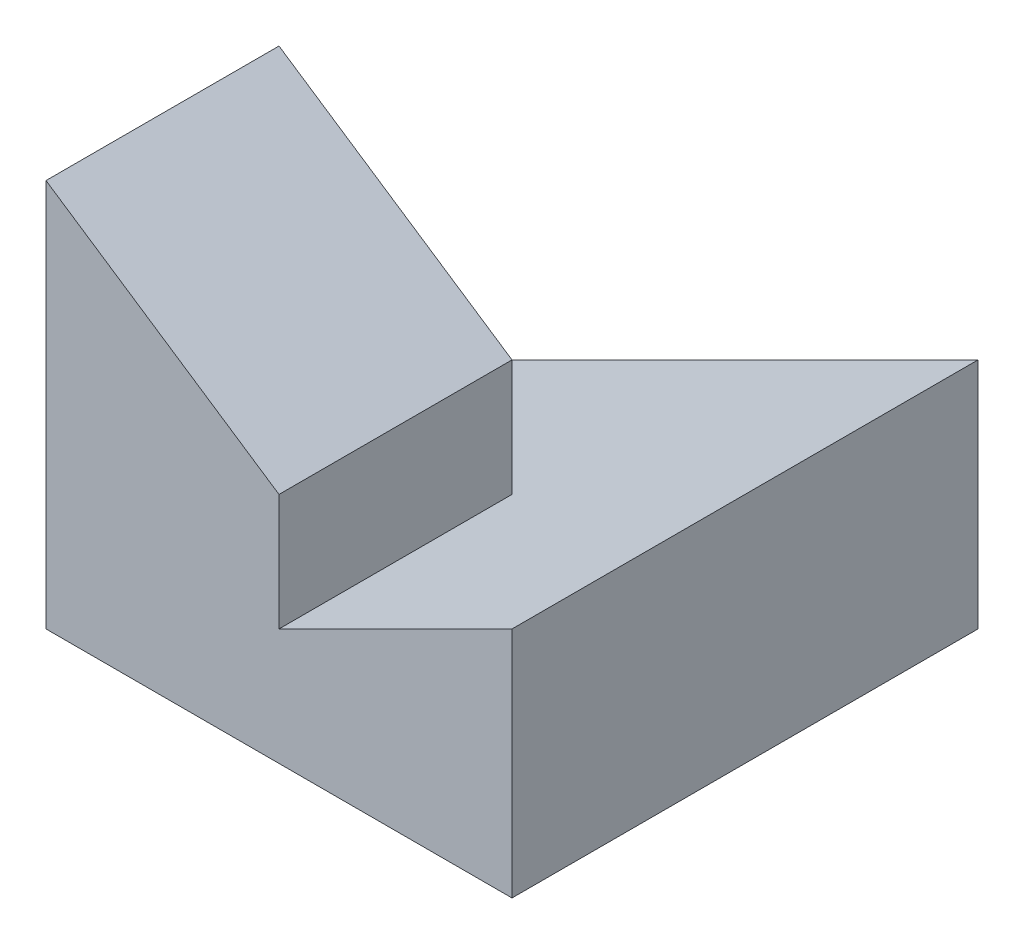
ISO-10303-21;
HEADER;
FILE_DESCRIPTION(('STEP AP214'),'2;1');
FILE_NAME('part.step','',(''),(''),'','','');
FILE_SCHEMA(('AUTOMOTIVE_DESIGN { 1 0 10303 214 1 1 1 1 }'));
ENDSEC;
DATA;
#1=APPLICATION_CONTEXT('core data for automotive mechanical design processes');
#2=APPLICATION_PROTOCOL_DEFINITION('international standard','automotive_design',2000,#1);
#3=PRODUCT_CONTEXT('',#1,'mechanical');
#4=PRODUCT('Part','Part','',(#3));
#5=PRODUCT_RELATED_PRODUCT_CATEGORY('part','',(#4));
#6=PRODUCT_DEFINITION_FORMATION('','',#4);
#7=PRODUCT_DEFINITION_CONTEXT('part definition',#1,'design');
#8=PRODUCT_DEFINITION('design','',#6,#7);
#9=PRODUCT_DEFINITION_SHAPE('','',#8);
#10=(LENGTH_UNIT() NAMED_UNIT(*) SI_UNIT(.MILLI.,.METRE.));
#11=(NAMED_UNIT(*) PLANE_ANGLE_UNIT() SI_UNIT($,.RADIAN.));
#12=(NAMED_UNIT(*) SI_UNIT($,.STERADIAN.) SOLID_ANGLE_UNIT());
#13=UNCERTAINTY_MEASURE_WITH_UNIT(LENGTH_MEASURE(1.E-05),#10,'distance_accuracy_value','');
#14=(GEOMETRIC_REPRESENTATION_CONTEXT(3) GLOBAL_UNCERTAINTY_ASSIGNED_CONTEXT((#13)) GLOBAL_UNIT_ASSIGNED_CONTEXT((#10,
#11,#12)) REPRESENTATION_CONTEXT('',''));
#15=CARTESIAN_POINT('',(0.,0.,0.));
#16=DIRECTION('',(0.,0.,1.));
#17=DIRECTION('',(1.,0.,0.));
#18=AXIS2_PLACEMENT_3D('',#15,#16,#17);
#19=CARTESIAN_POINT('',(-3.,5.,3.));
#20=DIRECTION('',(1.,0.,0.));
#21=DIRECTION('',(0.,0.,-1.));
#22=AXIS2_PLACEMENT_3D('',#19,#20,#21);
#23=PLANE('',#22);
#24=DIRECTION('',(0.,1.,0.));
#25=VECTOR('',#24,1.);
#26=CARTESIAN_POINT('',(-3.,0.,0.));
#27=LINE('',#26,#25);
#28=CARTESIAN_POINT('',(-3.,0.,0.));
#29=VERTEX_POINT('',#28);
#30=CARTESIAN_POINT('',(-3.,5.,0.));
#31=VERTEX_POINT('',#30);
#32=EDGE_CURVE('E94',#29,#31,#27,.T.);
#33=ORIENTED_EDGE('',*,*,#32,.F.);
#34=DIRECTION('',(0.,0.,1.));
#35=VECTOR('',#34,1.);
#36=CARTESIAN_POINT('',(-3.,0.,3.));
#37=LINE('',#36,#35);
#38=CARTESIAN_POINT('',(-3.,0.,3.));
#39=VERTEX_POINT('',#38);
#40=EDGE_CURVE('E56',#29,#39,#37,.T.);
#41=ORIENTED_EDGE('',*,*,#40,.T.);
#42=DIRECTION('',(0.,-1.,0.));
#43=VECTOR('',#42,1.);
#44=CARTESIAN_POINT('',(-3.,5.,3.));
#45=LINE('',#44,#43);
#46=CARTESIAN_POINT('',(-3.,5.,3.));
#47=VERTEX_POINT('',#46);
#48=EDGE_CURVE('E41',#47,#39,#45,.T.);
#49=ORIENTED_EDGE('',*,*,#48,.F.);
#50=DIRECTION('',(0.,0.,1.));
#51=VECTOR('',#50,1.);
#52=CARTESIAN_POINT('',(-3.,5.,0.));
#53=LINE('',#52,#51);
#54=EDGE_CURVE('E112',#31,#47,#53,.T.);
#55=ORIENTED_EDGE('',*,*,#54,.F.);
#56=EDGE_LOOP('',(#33,#41,#49,#55));
#57=FACE_BOUND('',#56,.T.);
#58=ADVANCED_FACE('F33',(#57),#23,.F.);
#59=CARTESIAN_POINT('',(3.,5.,3.));
#60=DIRECTION('',(-1.,0.,0.));
#61=DIRECTION('',(0.,0.,1.));
#62=AXIS2_PLACEMENT_3D('',#59,#60,#61);
#63=PLANE('',#62);
#64=DIRECTION('',(0.,-1.,0.));
#65=VECTOR('',#64,1.);
#66=CARTESIAN_POINT('',(3.,5.,-3.));
#67=LINE('',#66,#65);
#68=CARTESIAN_POINT('',(3.,3.,-3.));
#69=VERTEX_POINT('',#68);
#70=CARTESIAN_POINT('',(3.,0.,-3.));
#71=VERTEX_POINT('',#70);
#72=EDGE_CURVE('E11',#69,#71,#67,.T.);
#73=ORIENTED_EDGE('',*,*,#72,.F.);
#74=DIRECTION('',(0.,0.,1.));
#75=VECTOR('',#74,1.);
#76=CARTESIAN_POINT('',(3.,3.,0.));
#77=LINE('',#76,#75);
#78=CARTESIAN_POINT('',(3.,3.,3.));
#79=VERTEX_POINT('',#78);
#80=EDGE_CURVE('E142',#69,#79,#77,.T.);
#81=ORIENTED_EDGE('',*,*,#80,.T.);
#82=DIRECTION('',(0.,-1.,0.));
#83=VECTOR('',#82,1.);
#84=CARTESIAN_POINT('',(3.,5.,3.));
#85=LINE('',#84,#83);
#86=CARTESIAN_POINT('',(3.,0.,3.));
#87=VERTEX_POINT('',#86);
#88=EDGE_CURVE('E48',#79,#87,#85,.T.);
#89=ORIENTED_EDGE('',*,*,#88,.T.);
#90=DIRECTION('',(0.,0.,-1.));
#91=VECTOR('',#90,1.);
#92=CARTESIAN_POINT('',(3.,0.,3.));
#93=LINE('',#92,#91);
#94=EDGE_CURVE('E119',#87,#71,#93,.T.);
#95=ORIENTED_EDGE('',*,*,#94,.T.);
#96=EDGE_LOOP('',(#73,#81,#89,#95));
#97=FACE_BOUND('',#96,.T.);
#98=ADVANCED_FACE('F35',(#97),#63,.F.);
#99=CARTESIAN_POINT('',(-3.,5.,-3.));
#100=DIRECTION('',(0.,0.,1.));
#101=DIRECTION('',(1.,0.,0.));
#102=AXIS2_PLACEMENT_3D('',#99,#100,#101);
#103=PLANE('',#102);
#104=DIRECTION('',(-1.,0.,0.));
#105=VECTOR('',#104,1.);
#106=CARTESIAN_POINT('',(-3.,0.,-3.));
#107=LINE('',#106,#105);
#108=CARTESIAN_POINT('',(-3.,0.,-3.));
#109=VERTEX_POINT('',#108);
#110=EDGE_CURVE('E118',#71,#109,#107,.T.);
#111=ORIENTED_EDGE('',*,*,#110,.T.);
#112=DIRECTION('',(-0.894427190999916,-0.447213595499958,0.));
#113=VECTOR('',#112,1.);
#114=CARTESIAN_POINT('',(-0.6,1.2,-3.));
#115=LINE('',#114,#113);
#116=EDGE_CURVE('E100',#69,#109,#115,.T.);
#117=ORIENTED_EDGE('',*,*,#116,.F.);
#118=ORIENTED_EDGE('',*,*,#72,.T.);
#119=EDGE_LOOP('',(#111,#117,#118));
#120=FACE_BOUND('',#119,.T.);
#121=ADVANCED_FACE('F150',(#120),#103,.F.);
#122=CARTESIAN_POINT('',(-3.,5.,3.));
#123=DIRECTION('',(0.,0.,-1.));
#124=DIRECTION('',(-1.,0.,0.));
#125=AXIS2_PLACEMENT_3D('',#122,#123,#124);
#126=PLANE('',#125);
#127=ORIENTED_EDGE('',*,*,#88,.F.);
#128=DIRECTION('',(0.894427190999916,0.447213595499958,0.));
#129=VECTOR('',#128,1.);
#130=CARTESIAN_POINT('',(3.,3.,3.));
#131=LINE('',#130,#129);
#132=CARTESIAN_POINT('',(0.,1.5,3.));
#133=VERTEX_POINT('',#132);
#134=EDGE_CURVE('E135',#133,#79,#131,.T.);
#135=ORIENTED_EDGE('',*,*,#134,.F.);
#136=DIRECTION('',(0.,-1.,0.));
#137=VECTOR('',#136,1.);
#138=CARTESIAN_POINT('',(0.,1.5,3.));
#139=LINE('',#138,#137);
#140=CARTESIAN_POINT('',(0.,3.,3.));
#141=VERTEX_POINT('',#140);
#142=EDGE_CURVE('E131',#141,#133,#139,.T.);
#143=ORIENTED_EDGE('',*,*,#142,.F.);
#144=DIRECTION('',(0.832050294337844,-0.554700196225229,0.));
#145=VECTOR('',#144,1.);
#146=CARTESIAN_POINT('',(0.,3.,3.));
#147=LINE('',#146,#145);
#148=EDGE_CURVE('E113',#47,#141,#147,.T.);
#149=ORIENTED_EDGE('',*,*,#148,.F.);
#150=ORIENTED_EDGE('',*,*,#48,.T.);
#151=DIRECTION('',(1.,0.,0.));
#152=VECTOR('',#151,1.);
#153=CARTESIAN_POINT('',(-3.,0.,3.));
#154=LINE('',#153,#152);
#155=EDGE_CURVE('E109',#39,#87,#154,.T.);
#156=ORIENTED_EDGE('',*,*,#155,.T.);
#157=EDGE_LOOP('',(#127,#135,#143,#149,#150,#156));
#158=FACE_BOUND('',#157,.T.);
#159=ADVANCED_FACE('F126',(#158),#126,.F.);
#160=CARTESIAN_POINT('',(0.,0.,0.));
#161=DIRECTION('',(0.,-1.,0.));
#162=DIRECTION('',(0.,0.,-1.));
#163=AXIS2_PLACEMENT_3D('',#160,#161,#162);
#164=PLANE('',#163);
#165=ORIENTED_EDGE('',*,*,#94,.F.);
#166=ORIENTED_EDGE('',*,*,#155,.F.);
#167=ORIENTED_EDGE('',*,*,#40,.F.);
#168=EDGE_CURVE('E103',#109,#29,#37,.T.);
#169=ORIENTED_EDGE('',*,*,#168,.F.);
#170=ORIENTED_EDGE('',*,*,#110,.F.);
#171=EDGE_LOOP('',(#165,#166,#167,#169,#170));
#172=FACE_BOUND('',#171,.T.);
#173=ADVANCED_FACE('F117',(#172),#164,.T.);
#174=CARTESIAN_POINT('',(3.,3.,0.));
#175=DIRECTION('',(0.447213595499958,-0.894427190999916,0.));
#176=DIRECTION('',(0.894427190999916,0.447213595499958,0.));
#177=AXIS2_PLACEMENT_3D('',#174,#175,#176);
#178=PLANE('',#177);
#179=ORIENTED_EDGE('',*,*,#134,.T.);
#180=ORIENTED_EDGE('',*,*,#80,.F.);
#181=ORIENTED_EDGE('',*,*,#116,.T.);
#182=ORIENTED_EDGE('',*,*,#168,.T.);
#183=DIRECTION('',(-0.894427190999916,-0.447213595499958,0.));
#184=VECTOR('',#183,1.);
#185=CARTESIAN_POINT('',(-0.6,1.2,0.));
#186=LINE('',#185,#184);
#187=CARTESIAN_POINT('',(0.,1.5,0.));
#188=VERTEX_POINT('',#187);
#189=EDGE_CURVE('E91',#188,#29,#186,.T.);
#190=ORIENTED_EDGE('',*,*,#189,.F.);
#191=DIRECTION('',(0.,0.,1.));
#192=VECTOR('',#191,1.);
#193=CARTESIAN_POINT('',(0.,1.5,0.));
#194=LINE('',#193,#192);
#195=EDGE_CURVE('E144',#188,#133,#194,.T.);
#196=ORIENTED_EDGE('',*,*,#195,.T.);
#197=EDGE_LOOP('',(#179,#180,#181,#182,#190,#196));
#198=FACE_BOUND('',#197,.T.);
#199=ADVANCED_FACE('F104',(#198),#178,.F.);
#200=CARTESIAN_POINT('',(0.,1.5,0.));
#201=DIRECTION('',(-1.,0.,0.));
#202=DIRECTION('',(0.,0.,1.));
#203=AXIS2_PLACEMENT_3D('',#200,#201,#202);
#204=PLANE('',#203);
#205=ORIENTED_EDGE('',*,*,#142,.T.);
#206=ORIENTED_EDGE('',*,*,#195,.F.);
#207=DIRECTION('',(0.,-1.,0.));
#208=VECTOR('',#207,1.);
#209=CARTESIAN_POINT('',(0.,1.5,0.));
#210=LINE('',#209,#208);
#211=CARTESIAN_POINT('',(0.,3.,0.));
#212=VERTEX_POINT('',#211);
#213=EDGE_CURVE('E97',#212,#188,#210,.T.);
#214=ORIENTED_EDGE('',*,*,#213,.F.);
#215=DIRECTION('',(0.,0.,1.));
#216=VECTOR('',#215,1.);
#217=CARTESIAN_POINT('',(0.,3.,0.));
#218=LINE('',#217,#216);
#219=EDGE_CURVE('E146',#212,#141,#218,.T.);
#220=ORIENTED_EDGE('',*,*,#219,.T.);
#221=EDGE_LOOP('',(#205,#206,#214,#220));
#222=FACE_BOUND('',#221,.T.);
#223=ADVANCED_FACE('F154',(#222),#204,.F.);
#224=CARTESIAN_POINT('',(0.,3.,0.));
#225=DIRECTION('',(-0.554700196225229,-0.832050294337844,0.));
#226=DIRECTION('',(0.832050294337844,-0.554700196225229,0.));
#227=AXIS2_PLACEMENT_3D('',#224,#225,#226);
#228=PLANE('',#227);
#229=ORIENTED_EDGE('',*,*,#148,.T.);
#230=ORIENTED_EDGE('',*,*,#219,.F.);
#231=DIRECTION('',(0.832050294337844,-0.554700196225229,0.));
#232=VECTOR('',#231,1.);
#233=CARTESIAN_POINT('',(0.,3.,0.));
#234=LINE('',#233,#232);
#235=EDGE_CURVE('E141',#31,#212,#234,.T.);
#236=ORIENTED_EDGE('',*,*,#235,.F.);
#237=ORIENTED_EDGE('',*,*,#54,.T.);
#238=EDGE_LOOP('',(#229,#230,#236,#237));
#239=FACE_BOUND('',#238,.T.);
#240=ADVANCED_FACE('F152',(#239),#228,.F.);
#241=CARTESIAN_POINT('',(0.,0.,0.));
#242=DIRECTION('',(0.,0.,-1.));
#243=DIRECTION('',(-1.,0.,0.));
#244=AXIS2_PLACEMENT_3D('',#241,#242,#243);
#245=PLANE('',#244);
#246=ORIENTED_EDGE('',*,*,#213,.T.);
#247=ORIENTED_EDGE('',*,*,#189,.T.);
#248=ORIENTED_EDGE('',*,*,#32,.T.);
#249=ORIENTED_EDGE('',*,*,#235,.T.);
#250=EDGE_LOOP('',(#246,#247,#248,#249));
#251=FACE_BOUND('',#250,.T.);
#252=ADVANCED_FACE('F93',(#251),#245,.T.);
#253=CLOSED_SHELL('',(#58,#98,#121,#159,#173,#199,#223,#240,#252));
#254=MANIFOLD_SOLID_BREP('B2',#253);
#255=ADVANCED_BREP_SHAPE_REPRESENTATION('',(#18,#254),#14);
#256=SHAPE_DEFINITION_REPRESENTATION(#9,#255);
ENDSEC;
END-ISO-10303-21;
